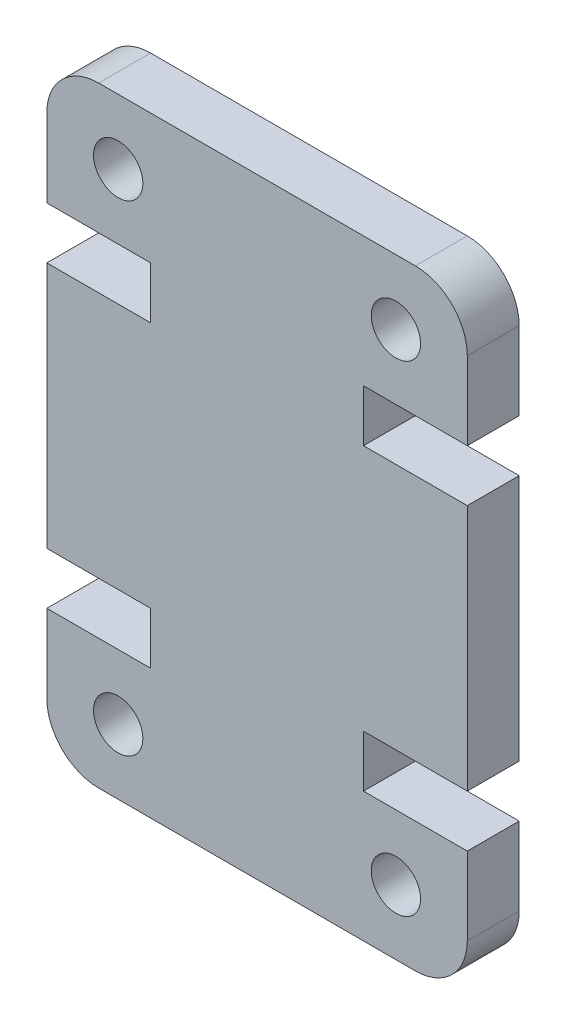
ISO-10303-21;
HEADER;
FILE_DESCRIPTION(('STEP AP214'),'2;1');
FILE_NAME('part.step','',(''),(''),'','','');
FILE_SCHEMA(('AUTOMOTIVE_DESIGN { 1 0 10303 214 1 1 1 1 }'));
ENDSEC;
DATA;
#1=APPLICATION_CONTEXT('core data for automotive mechanical design processes');
#2=APPLICATION_PROTOCOL_DEFINITION('international standard','automotive_design',2000,#1);
#3=PRODUCT_CONTEXT('',#1,'mechanical');
#4=PRODUCT('Part','Part','',(#3));
#5=PRODUCT_RELATED_PRODUCT_CATEGORY('part','',(#4));
#6=PRODUCT_DEFINITION_FORMATION('','',#4);
#7=PRODUCT_DEFINITION_CONTEXT('part definition',#1,'design');
#8=PRODUCT_DEFINITION('design','',#6,#7);
#9=PRODUCT_DEFINITION_SHAPE('','',#8);
#10=(LENGTH_UNIT() NAMED_UNIT(*) SI_UNIT(.MILLI.,.METRE.));
#11=(NAMED_UNIT(*) PLANE_ANGLE_UNIT() SI_UNIT($,.RADIAN.));
#12=(NAMED_UNIT(*) SI_UNIT($,.STERADIAN.) SOLID_ANGLE_UNIT());
#13=UNCERTAINTY_MEASURE_WITH_UNIT(LENGTH_MEASURE(1.E-05),#10,'distance_accuracy_value','');
#14=(GEOMETRIC_REPRESENTATION_CONTEXT(3) GLOBAL_UNCERTAINTY_ASSIGNED_CONTEXT((#13)) GLOBAL_UNIT_ASSIGNED_CONTEXT((#10,
#11,#12)) REPRESENTATION_CONTEXT('',''));
#15=CARTESIAN_POINT('',(0.,0.,0.));
#16=DIRECTION('',(0.,0.,1.));
#17=DIRECTION('',(1.,0.,0.));
#18=AXIS2_PLACEMENT_3D('',#15,#16,#17);
#19=CARTESIAN_POINT('',(14.2,2.,2.));
#20=DIRECTION('',(0.,0.,-1.));
#21=DIRECTION('',(-1.,0.,0.));
#22=AXIS2_PLACEMENT_3D('',#19,#20,#21);
#23=PLANE('',#22);
#24=CARTESIAN_POINT('',(13.4499999999986,21.0250000000001,2.));
#25=DIRECTION('',(0.,0.,1.));
#26=DIRECTION('',(1.,0.,0.));
#27=AXIS2_PLACEMENT_3D('',#24,#25,#26);
#28=CIRCLE('',#27,0.949999999999999);
#29=CARTESIAN_POINT('',(14.3999999999986,21.0250000000001,2.));
#30=VERTEX_POINT('',#29);
#31=EDGE_CURVE('E448',#30,#30,#28,.T.);
#32=ORIENTED_EDGE('',*,*,#31,.F.);
#33=EDGE_LOOP('',(#32));
#34=FACE_BOUND('',#33,.T.);
#35=CARTESIAN_POINT('',(13.4499999999986,2.4999999999999,2.));
#36=DIRECTION('',(0.,0.,1.));
#37=DIRECTION('',(-1.,0.,0.));
#38=AXIS2_PLACEMENT_3D('',#35,#36,#37);
#39=CIRCLE('',#38,0.949999999999999);
#40=CARTESIAN_POINT('',(12.4999999999986,2.4999999999999,2.));
#41=VERTEX_POINT('',#40);
#42=EDGE_CURVE('E230',#41,#41,#39,.T.);
#43=ORIENTED_EDGE('',*,*,#42,.F.);
#44=EDGE_LOOP('',(#43));
#45=FACE_BOUND('',#44,.T.);
#46=CARTESIAN_POINT('',(14.2,2.,2.));
#47=DIRECTION('',(0.,0.,1.));
#48=DIRECTION('',(-1.,0.,0.));
#49=AXIS2_PLACEMENT_3D('',#46,#47,#48);
#50=CIRCLE('',#49,2.);
#51=CARTESIAN_POINT('',(14.2,0.,2.));
#52=VERTEX_POINT('',#51);
#53=CARTESIAN_POINT('',(16.2,2.,2.));
#54=VERTEX_POINT('',#53);
#55=EDGE_CURVE('E273',#52,#54,#50,.T.);
#56=ORIENTED_EDGE('',*,*,#55,.T.);
#57=DIRECTION('',(0.,1.,0.));
#58=VECTOR('',#57,1.);
#59=CARTESIAN_POINT('',(16.2,5.00000000000014,2.));
#60=LINE('',#59,#58);
#61=CARTESIAN_POINT('',(16.2,5.00000000000014,2.));
#62=VERTEX_POINT('',#61);
#63=EDGE_CURVE('E141',#54,#62,#60,.T.);
#64=ORIENTED_EDGE('',*,*,#63,.T.);
#65=DIRECTION('',(-1.,0.,0.));
#66=VECTOR('',#65,1.);
#67=CARTESIAN_POINT('',(12.2,5.00000000000014,2.));
#68=LINE('',#67,#66);
#69=CARTESIAN_POINT('',(12.2,5.00000000000014,2.));
#70=VERTEX_POINT('',#69);
#71=EDGE_CURVE('E336',#62,#70,#68,.T.);
#72=ORIENTED_EDGE('',*,*,#71,.T.);
#73=DIRECTION('',(0.,1.,0.));
#74=VECTOR('',#73,1.);
#75=CARTESIAN_POINT('',(12.2,7.00000000000014,2.));
#76=LINE('',#75,#74);
#77=CARTESIAN_POINT('',(12.2,7.00000000000014,2.));
#78=VERTEX_POINT('',#77);
#79=EDGE_CURVE('E355',#70,#78,#76,.T.);
#80=ORIENTED_EDGE('',*,*,#79,.T.);
#81=DIRECTION('',(1.,0.,0.));
#82=VECTOR('',#81,1.);
#83=CARTESIAN_POINT('',(16.2,7.00000000000014,2.));
#84=LINE('',#83,#82);
#85=CARTESIAN_POINT('',(16.2,7.00000000000014,2.));
#86=VERTEX_POINT('',#85);
#87=EDGE_CURVE('E352',#78,#86,#84,.T.);
#88=ORIENTED_EDGE('',*,*,#87,.T.);
#89=DIRECTION('',(0.,1.,0.));
#90=VECTOR('',#89,1.);
#91=CARTESIAN_POINT('',(16.2,7.00000000000014,2.));
#92=LINE('',#91,#90);
#93=CARTESIAN_POINT('',(16.2,16.5249999999999,2.));
#94=VERTEX_POINT('',#93);
#95=EDGE_CURVE('E354',#86,#94,#92,.T.);
#96=ORIENTED_EDGE('',*,*,#95,.T.);
#97=DIRECTION('',(-1.,0.,0.));
#98=VECTOR('',#97,1.);
#99=CARTESIAN_POINT('',(16.2,16.5249999999999,2.));
#100=LINE('',#99,#98);
#101=CARTESIAN_POINT('',(12.2,16.5249999999999,2.));
#102=VERTEX_POINT('',#101);
#103=EDGE_CURVE('E357',#94,#102,#100,.T.);
#104=ORIENTED_EDGE('',*,*,#103,.T.);
#105=DIRECTION('',(0.,1.,0.));
#106=VECTOR('',#105,1.);
#107=CARTESIAN_POINT('',(12.2,16.5249999999999,2.));
#108=LINE('',#107,#106);
#109=CARTESIAN_POINT('',(12.2,18.5249999999999,2.));
#110=VERTEX_POINT('',#109);
#111=EDGE_CURVE('E363',#102,#110,#108,.T.);
#112=ORIENTED_EDGE('',*,*,#111,.T.);
#113=DIRECTION('',(1.,0.,0.));
#114=VECTOR('',#113,1.);
#115=CARTESIAN_POINT('',(12.2,18.5249999999999,2.));
#116=LINE('',#115,#114);
#117=CARTESIAN_POINT('',(16.2,18.5249999999999,2.));
#118=VERTEX_POINT('',#117);
#119=EDGE_CURVE('E365',#110,#118,#116,.T.);
#120=ORIENTED_EDGE('',*,*,#119,.T.);
#121=DIRECTION('',(0.,1.,0.));
#122=VECTOR('',#121,1.);
#123=CARTESIAN_POINT('',(16.2,18.5249999999999,2.));
#124=LINE('',#123,#122);
#125=CARTESIAN_POINT('',(16.2,21.525,2.));
#126=VERTEX_POINT('',#125);
#127=EDGE_CURVE('E367',#118,#126,#124,.T.);
#128=ORIENTED_EDGE('',*,*,#127,.T.);
#129=CARTESIAN_POINT('',(14.2,21.525,2.));
#130=DIRECTION('',(0.,0.,1.));
#131=DIRECTION('',(1.,0.,0.));
#132=AXIS2_PLACEMENT_3D('',#129,#130,#131);
#133=CIRCLE('',#132,2.);
#134=CARTESIAN_POINT('',(14.2,23.525,2.));
#135=VERTEX_POINT('',#134);
#136=EDGE_CURVE('E369',#126,#135,#133,.T.);
#137=ORIENTED_EDGE('',*,*,#136,.T.);
#138=DIRECTION('',(-1.,0.,0.));
#139=VECTOR('',#138,1.);
#140=CARTESIAN_POINT('',(1.99999999999999,23.525,2.));
#141=LINE('',#140,#139);
#142=CARTESIAN_POINT('',(1.99999999999999,23.525,2.));
#143=VERTEX_POINT('',#142);
#144=EDGE_CURVE('E371',#135,#143,#141,.T.);
#145=ORIENTED_EDGE('',*,*,#144,.T.);
#146=CARTESIAN_POINT('',(2.,21.525,2.));
#147=DIRECTION('',(0.,0.,1.));
#148=DIRECTION('',(-1.,0.,0.));
#149=AXIS2_PLACEMENT_3D('',#146,#147,#148);
#150=CIRCLE('',#149,2.);
#151=CARTESIAN_POINT('',(0.,21.525,2.));
#152=VERTEX_POINT('',#151);
#153=EDGE_CURVE('E373',#143,#152,#150,.T.);
#154=ORIENTED_EDGE('',*,*,#153,.T.);
#155=DIRECTION('',(0.,-1.,0.));
#156=VECTOR('',#155,1.);
#157=CARTESIAN_POINT('',(0.,18.5249999999999,2.));
#158=LINE('',#157,#156);
#159=CARTESIAN_POINT('',(0.,18.5249999999999,2.));
#160=VERTEX_POINT('',#159);
#161=EDGE_CURVE('E375',#152,#160,#158,.T.);
#162=ORIENTED_EDGE('',*,*,#161,.T.);
#163=DIRECTION('',(1.,0.,0.));
#164=VECTOR('',#163,1.);
#165=CARTESIAN_POINT('',(4.,18.5249999999999,2.));
#166=LINE('',#165,#164);
#167=CARTESIAN_POINT('',(4.,18.5249999999999,2.));
#168=VERTEX_POINT('',#167);
#169=EDGE_CURVE('E377',#160,#168,#166,.T.);
#170=ORIENTED_EDGE('',*,*,#169,.T.);
#171=DIRECTION('',(0.,-1.,0.));
#172=VECTOR('',#171,1.);
#173=CARTESIAN_POINT('',(4.,16.5249999999999,2.));
#174=LINE('',#173,#172);
#175=CARTESIAN_POINT('',(4.,16.5249999999999,2.));
#176=VERTEX_POINT('',#175);
#177=EDGE_CURVE('E379',#168,#176,#174,.T.);
#178=ORIENTED_EDGE('',*,*,#177,.T.);
#179=DIRECTION('',(-1.,0.,0.));
#180=VECTOR('',#179,1.);
#181=CARTESIAN_POINT('',(0.,16.5249999999999,2.));
#182=LINE('',#181,#180);
#183=CARTESIAN_POINT('',(0.,16.5249999999999,2.));
#184=VERTEX_POINT('',#183);
#185=EDGE_CURVE('E381',#176,#184,#182,.T.);
#186=ORIENTED_EDGE('',*,*,#185,.T.);
#187=DIRECTION('',(0.,-1.,0.));
#188=VECTOR('',#187,1.);
#189=CARTESIAN_POINT('',(0.,7.00000000000012,2.));
#190=LINE('',#189,#188);
#191=CARTESIAN_POINT('',(0.,7.00000000000012,2.));
#192=VERTEX_POINT('',#191);
#193=EDGE_CURVE('E383',#184,#192,#190,.T.);
#194=ORIENTED_EDGE('',*,*,#193,.T.);
#195=DIRECTION('',(1.,0.,0.));
#196=VECTOR('',#195,1.);
#197=CARTESIAN_POINT('',(0.,7.00000000000012,2.));
#198=LINE('',#197,#196);
#199=CARTESIAN_POINT('',(4.,7.00000000000014,2.));
#200=VERTEX_POINT('',#199);
#201=EDGE_CURVE('E385',#192,#200,#198,.T.);
#202=ORIENTED_EDGE('',*,*,#201,.T.);
#203=DIRECTION('',(0.,-1.,0.));
#204=VECTOR('',#203,1.);
#205=CARTESIAN_POINT('',(4.,7.00000000000014,2.));
#206=LINE('',#205,#204);
#207=CARTESIAN_POINT('',(4.,5.00000000000014,2.));
#208=VERTEX_POINT('',#207);
#209=EDGE_CURVE('E387',#200,#208,#206,.T.);
#210=ORIENTED_EDGE('',*,*,#209,.T.);
#211=DIRECTION('',(-1.,0.,0.));
#212=VECTOR('',#211,1.);
#213=CARTESIAN_POINT('',(4.,5.00000000000014,2.));
#214=LINE('',#213,#212);
#215=CARTESIAN_POINT('',(0.,5.00000000000014,2.));
#216=VERTEX_POINT('',#215);
#217=EDGE_CURVE('E208',#208,#216,#214,.T.);
#218=ORIENTED_EDGE('',*,*,#217,.T.);
#219=DIRECTION('',(0.,-1.,0.));
#220=VECTOR('',#219,1.);
#221=CARTESIAN_POINT('',(0.,5.00000000000014,2.));
#222=LINE('',#221,#220);
#223=CARTESIAN_POINT('',(0.,2.00000000000002,2.));
#224=VERTEX_POINT('',#223);
#225=EDGE_CURVE('E202',#216,#224,#222,.T.);
#226=ORIENTED_EDGE('',*,*,#225,.T.);
#227=CARTESIAN_POINT('',(2.,2.,2.));
#228=DIRECTION('',(0.,0.,1.));
#229=DIRECTION('',(1.,0.,0.));
#230=AXIS2_PLACEMENT_3D('',#227,#228,#229);
#231=CIRCLE('',#230,2.);
#232=CARTESIAN_POINT('',(2.,0.,2.));
#233=VERTEX_POINT('',#232);
#234=EDGE_CURVE('E206',#224,#233,#231,.T.);
#235=ORIENTED_EDGE('',*,*,#234,.T.);
#236=DIRECTION('',(1.,0.,0.));
#237=VECTOR('',#236,1.);
#238=CARTESIAN_POINT('',(2.,0.,2.));
#239=LINE('',#238,#237);
#240=EDGE_CURVE('E50',#233,#52,#239,.T.);
#241=ORIENTED_EDGE('',*,*,#240,.T.);
#242=EDGE_LOOP('',(#56,#64,#72,#80,#88,#96,#104,#112,#120,#128,#137,#145,#154,#162,#170,#178,
#186,#194,#202,#210,#218,#226,#235,#241));
#243=FACE_BOUND('',#242,.T.);
#244=CARTESIAN_POINT('',(2.75000000000137,21.0250000000001,2.));
#245=DIRECTION('',(0.,0.,1.));
#246=DIRECTION('',(-1.,0.,0.));
#247=AXIS2_PLACEMENT_3D('',#244,#245,#246);
#248=CIRCLE('',#247,0.95);
#249=CARTESIAN_POINT('',(1.80000000000137,21.0250000000001,2.));
#250=VERTEX_POINT('',#249);
#251=EDGE_CURVE('E454',#250,#250,#248,.T.);
#252=ORIENTED_EDGE('',*,*,#251,.F.);
#253=EDGE_LOOP('',(#252));
#254=FACE_BOUND('',#253,.T.);
#255=CARTESIAN_POINT('',(2.75000000000138,2.4999999999999,2.));
#256=DIRECTION('',(0.,0.,1.));
#257=DIRECTION('',(1.,0.,0.));
#258=AXIS2_PLACEMENT_3D('',#255,#256,#257);
#259=CIRCLE('',#258,0.95);
#260=CARTESIAN_POINT('',(3.70000000000138,2.4999999999999,2.));
#261=VERTEX_POINT('',#260);
#262=EDGE_CURVE('E439',#261,#261,#259,.T.);
#263=ORIENTED_EDGE('',*,*,#262,.F.);
#264=EDGE_LOOP('',(#263));
#265=FACE_BOUND('',#264,.T.);
#266=ADVANCED_FACE('F33',(#34,#45,#243,#254,#265),#23,.F.);
#267=CARTESIAN_POINT('',(14.2,2.,0.));
#268=DIRECTION('',(0.,0.,-1.));
#269=DIRECTION('',(-1.,0.,0.));
#270=AXIS2_PLACEMENT_3D('',#267,#268,#269);
#271=PLANE('',#270);
#272=CARTESIAN_POINT('',(13.4499999999986,21.0250000000001,0.));
#273=DIRECTION('',(0.,0.,1.));
#274=DIRECTION('',(1.,0.,0.));
#275=AXIS2_PLACEMENT_3D('',#272,#273,#274);
#276=CIRCLE('',#275,0.949999999999999);
#277=CARTESIAN_POINT('',(14.3999999999986,21.0250000000001,0.));
#278=VERTEX_POINT('',#277);
#279=EDGE_CURVE('E445',#278,#278,#276,.T.);
#280=ORIENTED_EDGE('',*,*,#279,.T.);
#281=EDGE_LOOP('',(#280));
#282=FACE_BOUND('',#281,.T.);
#283=CARTESIAN_POINT('',(13.4499999999986,2.4999999999999,0.));
#284=DIRECTION('',(0.,0.,1.));
#285=DIRECTION('',(-1.,0.,0.));
#286=AXIS2_PLACEMENT_3D('',#283,#284,#285);
#287=CIRCLE('',#286,0.949999999999999);
#288=CARTESIAN_POINT('',(12.4999999999986,2.4999999999999,0.));
#289=VERTEX_POINT('',#288);
#290=EDGE_CURVE('E457',#289,#289,#287,.T.);
#291=ORIENTED_EDGE('',*,*,#290,.T.);
#292=EDGE_LOOP('',(#291));
#293=FACE_BOUND('',#292,.T.);
#294=CARTESIAN_POINT('',(14.2,2.,0.));
#295=DIRECTION('',(0.,0.,1.));
#296=DIRECTION('',(-1.,0.,0.));
#297=AXIS2_PLACEMENT_3D('',#294,#295,#296);
#298=CIRCLE('',#297,2.);
#299=CARTESIAN_POINT('',(14.2,0.,0.));
#300=VERTEX_POINT('',#299);
#301=CARTESIAN_POINT('',(16.2,2.,0.));
#302=VERTEX_POINT('',#301);
#303=EDGE_CURVE('E226',#300,#302,#298,.T.);
#304=ORIENTED_EDGE('',*,*,#303,.F.);
#305=DIRECTION('',(1.,0.,0.));
#306=VECTOR('',#305,1.);
#307=CARTESIAN_POINT('',(2.,0.,0.));
#308=LINE('',#307,#306);
#309=CARTESIAN_POINT('',(2.,0.,0.));
#310=VERTEX_POINT('',#309);
#311=EDGE_CURVE('E133',#310,#300,#308,.T.);
#312=ORIENTED_EDGE('',*,*,#311,.F.);
#313=CARTESIAN_POINT('',(2.,2.,0.));
#314=DIRECTION('',(0.,0.,1.));
#315=DIRECTION('',(1.,0.,0.));
#316=AXIS2_PLACEMENT_3D('',#313,#314,#315);
#317=CIRCLE('',#316,2.);
#318=CARTESIAN_POINT('',(0.,2.00000000000002,0.));
#319=VERTEX_POINT('',#318);
#320=EDGE_CURVE('E127',#319,#310,#317,.T.);
#321=ORIENTED_EDGE('',*,*,#320,.F.);
#322=DIRECTION('',(0.,-1.,0.));
#323=VECTOR('',#322,1.);
#324=CARTESIAN_POINT('',(0.,5.00000000000014,0.));
#325=LINE('',#324,#323);
#326=CARTESIAN_POINT('',(0.,5.00000000000014,0.));
#327=VERTEX_POINT('',#326);
#328=EDGE_CURVE('E216',#327,#319,#325,.T.);
#329=ORIENTED_EDGE('',*,*,#328,.F.);
#330=DIRECTION('',(-1.,0.,0.));
#331=VECTOR('',#330,1.);
#332=CARTESIAN_POINT('',(4.,5.00000000000014,0.));
#333=LINE('',#332,#331);
#334=CARTESIAN_POINT('',(4.,5.00000000000014,0.));
#335=VERTEX_POINT('',#334);
#336=EDGE_CURVE('E268',#335,#327,#333,.T.);
#337=ORIENTED_EDGE('',*,*,#336,.F.);
#338=DIRECTION('',(0.,-1.,0.));
#339=VECTOR('',#338,1.);
#340=CARTESIAN_POINT('',(4.,7.00000000000014,0.));
#341=LINE('',#340,#339);
#342=CARTESIAN_POINT('',(4.,7.00000000000014,0.));
#343=VERTEX_POINT('',#342);
#344=EDGE_CURVE('E266',#343,#335,#341,.T.);
#345=ORIENTED_EDGE('',*,*,#344,.F.);
#346=DIRECTION('',(1.,0.,0.));
#347=VECTOR('',#346,1.);
#348=CARTESIAN_POINT('',(0.,7.00000000000012,0.));
#349=LINE('',#348,#347);
#350=CARTESIAN_POINT('',(0.,7.00000000000012,0.));
#351=VERTEX_POINT('',#350);
#352=EDGE_CURVE('E264',#351,#343,#349,.T.);
#353=ORIENTED_EDGE('',*,*,#352,.F.);
#354=DIRECTION('',(0.,-1.,0.));
#355=VECTOR('',#354,1.);
#356=CARTESIAN_POINT('',(0.,7.00000000000012,0.));
#357=LINE('',#356,#355);
#358=CARTESIAN_POINT('',(0.,16.5249999999999,0.));
#359=VERTEX_POINT('',#358);
#360=EDGE_CURVE('E262',#359,#351,#357,.T.);
#361=ORIENTED_EDGE('',*,*,#360,.F.);
#362=DIRECTION('',(-1.,0.,0.));
#363=VECTOR('',#362,1.);
#364=CARTESIAN_POINT('',(0.,16.5249999999999,0.));
#365=LINE('',#364,#363);
#366=CARTESIAN_POINT('',(4.,16.5249999999999,0.));
#367=VERTEX_POINT('',#366);
#368=EDGE_CURVE('E260',#367,#359,#365,.T.);
#369=ORIENTED_EDGE('',*,*,#368,.F.);
#370=DIRECTION('',(0.,-1.,0.));
#371=VECTOR('',#370,1.);
#372=CARTESIAN_POINT('',(4.,16.5249999999999,0.));
#373=LINE('',#372,#371);
#374=CARTESIAN_POINT('',(4.,18.5249999999999,0.));
#375=VERTEX_POINT('',#374);
#376=EDGE_CURVE('E258',#375,#367,#373,.T.);
#377=ORIENTED_EDGE('',*,*,#376,.F.);
#378=DIRECTION('',(1.,0.,0.));
#379=VECTOR('',#378,1.);
#380=CARTESIAN_POINT('',(4.,18.5249999999999,0.));
#381=LINE('',#380,#379);
#382=CARTESIAN_POINT('',(0.,18.5249999999999,0.));
#383=VERTEX_POINT('',#382);
#384=EDGE_CURVE('E256',#383,#375,#381,.T.);
#385=ORIENTED_EDGE('',*,*,#384,.F.);
#386=DIRECTION('',(0.,-1.,0.));
#387=VECTOR('',#386,1.);
#388=CARTESIAN_POINT('',(0.,18.5249999999999,0.));
#389=LINE('',#388,#387);
#390=CARTESIAN_POINT('',(0.,21.525,0.));
#391=VERTEX_POINT('',#390);
#392=EDGE_CURVE('E254',#391,#383,#389,.T.);
#393=ORIENTED_EDGE('',*,*,#392,.F.);
#394=CARTESIAN_POINT('',(2.,21.525,0.));
#395=DIRECTION('',(0.,0.,1.));
#396=DIRECTION('',(-1.,0.,0.));
#397=AXIS2_PLACEMENT_3D('',#394,#395,#396);
#398=CIRCLE('',#397,2.);
#399=CARTESIAN_POINT('',(1.99999999999999,23.525,0.));
#400=VERTEX_POINT('',#399);
#401=EDGE_CURVE('E252',#400,#391,#398,.T.);
#402=ORIENTED_EDGE('',*,*,#401,.F.);
#403=DIRECTION('',(-1.,0.,0.));
#404=VECTOR('',#403,1.);
#405=CARTESIAN_POINT('',(1.99999999999999,23.525,0.));
#406=LINE('',#405,#404);
#407=CARTESIAN_POINT('',(14.2,23.525,0.));
#408=VERTEX_POINT('',#407);
#409=EDGE_CURVE('E250',#408,#400,#406,.T.);
#410=ORIENTED_EDGE('',*,*,#409,.F.);
#411=CARTESIAN_POINT('',(14.2,21.525,0.));
#412=DIRECTION('',(0.,0.,1.));
#413=DIRECTION('',(1.,0.,0.));
#414=AXIS2_PLACEMENT_3D('',#411,#412,#413);
#415=CIRCLE('',#414,2.);
#416=CARTESIAN_POINT('',(16.2,21.525,0.));
#417=VERTEX_POINT('',#416);
#418=EDGE_CURVE('E248',#417,#408,#415,.T.);
#419=ORIENTED_EDGE('',*,*,#418,.F.);
#420=DIRECTION('',(0.,1.,0.));
#421=VECTOR('',#420,1.);
#422=CARTESIAN_POINT('',(16.2,18.5249999999999,0.));
#423=LINE('',#422,#421);
#424=CARTESIAN_POINT('',(16.2,18.5249999999999,0.));
#425=VERTEX_POINT('',#424);
#426=EDGE_CURVE('E246',#425,#417,#423,.T.);
#427=ORIENTED_EDGE('',*,*,#426,.F.);
#428=DIRECTION('',(1.,0.,0.));
#429=VECTOR('',#428,1.);
#430=CARTESIAN_POINT('',(12.2,18.5249999999999,0.));
#431=LINE('',#430,#429);
#432=CARTESIAN_POINT('',(12.2,18.5249999999999,0.));
#433=VERTEX_POINT('',#432);
#434=EDGE_CURVE('E244',#433,#425,#431,.T.);
#435=ORIENTED_EDGE('',*,*,#434,.F.);
#436=DIRECTION('',(0.,1.,0.));
#437=VECTOR('',#436,1.);
#438=CARTESIAN_POINT('',(12.2,16.5249999999999,0.));
#439=LINE('',#438,#437);
#440=CARTESIAN_POINT('',(12.2,16.5249999999999,0.));
#441=VERTEX_POINT('',#440);
#442=EDGE_CURVE('E242',#441,#433,#439,.T.);
#443=ORIENTED_EDGE('',*,*,#442,.F.);
#444=DIRECTION('',(-1.,0.,0.));
#445=VECTOR('',#444,1.);
#446=CARTESIAN_POINT('',(16.2,16.5249999999999,0.));
#447=LINE('',#446,#445);
#448=CARTESIAN_POINT('',(16.2,16.5249999999999,0.));
#449=VERTEX_POINT('',#448);
#450=EDGE_CURVE('E240',#449,#441,#447,.T.);
#451=ORIENTED_EDGE('',*,*,#450,.F.);
#452=DIRECTION('',(0.,1.,0.));
#453=VECTOR('',#452,1.);
#454=CARTESIAN_POINT('',(16.2,7.00000000000014,0.));
#455=LINE('',#454,#453);
#456=CARTESIAN_POINT('',(16.2,7.00000000000014,0.));
#457=VERTEX_POINT('',#456);
#458=EDGE_CURVE('E238',#457,#449,#455,.T.);
#459=ORIENTED_EDGE('',*,*,#458,.F.);
#460=DIRECTION('',(1.,0.,0.));
#461=VECTOR('',#460,1.);
#462=CARTESIAN_POINT('',(16.2,7.00000000000014,0.));
#463=LINE('',#462,#461);
#464=CARTESIAN_POINT('',(12.2,7.00000000000014,0.));
#465=VERTEX_POINT('',#464);
#466=EDGE_CURVE('E236',#465,#457,#463,.T.);
#467=ORIENTED_EDGE('',*,*,#466,.F.);
#468=DIRECTION('',(0.,1.,0.));
#469=VECTOR('',#468,1.);
#470=CARTESIAN_POINT('',(12.2,7.00000000000014,0.));
#471=LINE('',#470,#469);
#472=CARTESIAN_POINT('',(12.2,5.00000000000014,0.));
#473=VERTEX_POINT('',#472);
#474=EDGE_CURVE('E234',#473,#465,#471,.T.);
#475=ORIENTED_EDGE('',*,*,#474,.F.);
#476=DIRECTION('',(-1.,0.,0.));
#477=VECTOR('',#476,1.);
#478=CARTESIAN_POINT('',(12.2,5.00000000000014,0.));
#479=LINE('',#478,#477);
#480=CARTESIAN_POINT('',(16.2,5.00000000000014,0.));
#481=VERTEX_POINT('',#480);
#482=EDGE_CURVE('E232',#481,#473,#479,.T.);
#483=ORIENTED_EDGE('',*,*,#482,.F.);
#484=DIRECTION('',(0.,1.,0.));
#485=VECTOR('',#484,1.);
#486=CARTESIAN_POINT('',(16.2,5.00000000000014,0.));
#487=LINE('',#486,#485);
#488=EDGE_CURVE('E229',#302,#481,#487,.T.);
#489=ORIENTED_EDGE('',*,*,#488,.F.);
#490=EDGE_LOOP('',(#304,#312,#321,#329,#337,#345,#353,#361,#369,#377,#385,#393,#402,#410,#419,
#427,#435,#443,#451,#459,#467,#475,#483,#489));
#491=FACE_BOUND('',#490,.T.);
#492=CARTESIAN_POINT('',(2.75000000000137,21.0250000000001,0.));
#493=DIRECTION('',(0.,0.,1.));
#494=DIRECTION('',(-1.,0.,0.));
#495=AXIS2_PLACEMENT_3D('',#492,#493,#494);
#496=CIRCLE('',#495,0.95);
#497=CARTESIAN_POINT('',(1.80000000000137,21.0250000000001,0.));
#498=VERTEX_POINT('',#497);
#499=EDGE_CURVE('E451',#498,#498,#496,.T.);
#500=ORIENTED_EDGE('',*,*,#499,.T.);
#501=EDGE_LOOP('',(#500));
#502=FACE_BOUND('',#501,.T.);
#503=CARTESIAN_POINT('',(2.75000000000138,2.4999999999999,0.));
#504=DIRECTION('',(0.,0.,1.));
#505=DIRECTION('',(1.,0.,0.));
#506=AXIS2_PLACEMENT_3D('',#503,#504,#505);
#507=CIRCLE('',#506,0.95);
#508=CARTESIAN_POINT('',(3.70000000000138,2.4999999999999,0.));
#509=VERTEX_POINT('',#508);
#510=EDGE_CURVE('E442',#509,#509,#507,.T.);
#511=ORIENTED_EDGE('',*,*,#510,.T.);
#512=EDGE_LOOP('',(#511));
#513=FACE_BOUND('',#512,.T.);
#514=ADVANCED_FACE('F340',(#282,#293,#491,#502,#513),#271,.T.);
#515=CARTESIAN_POINT('',(14.2,2.,2.));
#516=DIRECTION('',(0.,0.,-1.));
#517=DIRECTION('',(-1.,0.,0.));
#518=AXIS2_PLACEMENT_3D('',#515,#516,#517);
#519=CYLINDRICAL_SURFACE('',#518,2.);
#520=ORIENTED_EDGE('',*,*,#303,.T.);
#521=DIRECTION('',(0.,0.,-1.));
#522=VECTOR('',#521,1.);
#523=CARTESIAN_POINT('',(16.2,2.,2.));
#524=LINE('',#523,#522);
#525=EDGE_CURVE('E11',#54,#302,#524,.T.);
#526=ORIENTED_EDGE('',*,*,#525,.F.);
#527=ORIENTED_EDGE('',*,*,#55,.F.);
#528=DIRECTION('',(0.,0.,-1.));
#529=VECTOR('',#528,1.);
#530=CARTESIAN_POINT('',(14.2,0.,2.));
#531=LINE('',#530,#529);
#532=EDGE_CURVE('E222',#52,#300,#531,.T.);
#533=ORIENTED_EDGE('',*,*,#532,.T.);
#534=EDGE_LOOP('',(#520,#526,#527,#533));
#535=FACE_BOUND('',#534,.T.);
#536=ADVANCED_FACE('F35',(#535),#519,.T.);
#537=CARTESIAN_POINT('',(16.2,5.00000000000014,2.));
#538=DIRECTION('',(-1.,0.,0.));
#539=DIRECTION('',(0.,-1.,0.));
#540=AXIS2_PLACEMENT_3D('',#537,#538,#539);
#541=PLANE('',#540);
#542=ORIENTED_EDGE('',*,*,#488,.T.);
#543=DIRECTION('',(0.,0.,-1.));
#544=VECTOR('',#543,1.);
#545=CARTESIAN_POINT('',(16.2,5.00000000000014,2.));
#546=LINE('',#545,#544);
#547=EDGE_CURVE('E42',#62,#481,#546,.T.);
#548=ORIENTED_EDGE('',*,*,#547,.F.);
#549=ORIENTED_EDGE('',*,*,#63,.F.);
#550=ORIENTED_EDGE('',*,*,#525,.T.);
#551=EDGE_LOOP('',(#542,#548,#549,#550));
#552=FACE_BOUND('',#551,.T.);
#553=ADVANCED_FACE('F686',(#552),#541,.F.);
#554=CARTESIAN_POINT('',(12.2,5.00000000000014,2.));
#555=DIRECTION('',(0.,-1.,0.));
#556=DIRECTION('',(0.,0.,-1.));
#557=AXIS2_PLACEMENT_3D('',#554,#555,#556);
#558=PLANE('',#557);
#559=ORIENTED_EDGE('',*,*,#482,.T.);
#560=DIRECTION('',(0.,0.,-1.));
#561=VECTOR('',#560,1.);
#562=CARTESIAN_POINT('',(12.2,5.00000000000014,2.));
#563=LINE('',#562,#561);
#564=EDGE_CURVE('E328',#70,#473,#563,.T.);
#565=ORIENTED_EDGE('',*,*,#564,.F.);
#566=ORIENTED_EDGE('',*,*,#71,.F.);
#567=ORIENTED_EDGE('',*,*,#547,.T.);
#568=EDGE_LOOP('',(#559,#565,#566,#567));
#569=FACE_BOUND('',#568,.T.);
#570=ADVANCED_FACE('F334',(#569),#558,.F.);
#571=CARTESIAN_POINT('',(12.2,7.00000000000014,2.));
#572=DIRECTION('',(-1.,0.,0.));
#573=DIRECTION('',(0.,0.,1.));
#574=AXIS2_PLACEMENT_3D('',#571,#572,#573);
#575=PLANE('',#574);
#576=ORIENTED_EDGE('',*,*,#474,.T.);
#577=DIRECTION('',(0.,0.,-1.));
#578=VECTOR('',#577,1.);
#579=CARTESIAN_POINT('',(12.2,7.00000000000014,2.));
#580=LINE('',#579,#578);
#581=EDGE_CURVE('E325',#78,#465,#580,.T.);
#582=ORIENTED_EDGE('',*,*,#581,.F.);
#583=ORIENTED_EDGE('',*,*,#79,.F.);
#584=ORIENTED_EDGE('',*,*,#564,.T.);
#585=EDGE_LOOP('',(#576,#582,#583,#584));
#586=FACE_BOUND('',#585,.T.);
#587=ADVANCED_FACE('F346',(#586),#575,.F.);
#588=CARTESIAN_POINT('',(16.2,7.00000000000014,2.));
#589=DIRECTION('',(0.,1.,0.));
#590=DIRECTION('',(-1.,0.,0.));
#591=AXIS2_PLACEMENT_3D('',#588,#589,#590);
#592=PLANE('',#591);
#593=ORIENTED_EDGE('',*,*,#466,.T.);
#594=DIRECTION('',(0.,0.,-1.));
#595=VECTOR('',#594,1.);
#596=CARTESIAN_POINT('',(16.2,7.00000000000014,2.));
#597=LINE('',#596,#595);
#598=EDGE_CURVE('E322',#86,#457,#597,.T.);
#599=ORIENTED_EDGE('',*,*,#598,.F.);
#600=ORIENTED_EDGE('',*,*,#87,.F.);
#601=ORIENTED_EDGE('',*,*,#581,.T.);
#602=EDGE_LOOP('',(#593,#599,#600,#601));
#603=FACE_BOUND('',#602,.T.);
#604=ADVANCED_FACE('F350',(#603),#592,.F.);
#605=CARTESIAN_POINT('',(16.2,7.00000000000014,2.));
#606=DIRECTION('',(-1.,0.,0.));
#607=DIRECTION('',(0.,0.,1.));
#608=AXIS2_PLACEMENT_3D('',#605,#606,#607);
#609=PLANE('',#608);
#610=ORIENTED_EDGE('',*,*,#458,.T.);
#611=DIRECTION('',(0.,0.,-1.));
#612=VECTOR('',#611,1.);
#613=CARTESIAN_POINT('',(16.2,16.5249999999999,2.));
#614=LINE('',#613,#612);
#615=EDGE_CURVE('E319',#94,#449,#614,.T.);
#616=ORIENTED_EDGE('',*,*,#615,.F.);
#617=ORIENTED_EDGE('',*,*,#95,.F.);
#618=ORIENTED_EDGE('',*,*,#598,.T.);
#619=EDGE_LOOP('',(#610,#616,#617,#618));
#620=FACE_BOUND('',#619,.T.);
#621=ADVANCED_FACE('F651',(#620),#609,.F.);
#622=CARTESIAN_POINT('',(16.2,16.5249999999999,2.));
#623=DIRECTION('',(0.,-1.,0.));
#624=DIRECTION('',(1.,0.,0.));
#625=AXIS2_PLACEMENT_3D('',#622,#623,#624);
#626=PLANE('',#625);
#627=ORIENTED_EDGE('',*,*,#450,.T.);
#628=DIRECTION('',(0.,0.,-1.));
#629=VECTOR('',#628,1.);
#630=CARTESIAN_POINT('',(12.2,16.5249999999999,2.));
#631=LINE('',#630,#629);
#632=EDGE_CURVE('E316',#102,#441,#631,.T.);
#633=ORIENTED_EDGE('',*,*,#632,.F.);
#634=ORIENTED_EDGE('',*,*,#103,.F.);
#635=ORIENTED_EDGE('',*,*,#615,.T.);
#636=EDGE_LOOP('',(#627,#633,#634,#635));
#637=FACE_BOUND('',#636,.T.);
#638=ADVANCED_FACE('F641',(#637),#626,.F.);
#639=CARTESIAN_POINT('',(12.2,16.5249999999999,2.));
#640=DIRECTION('',(-1.,0.,0.));
#641=DIRECTION('',(0.,0.,1.));
#642=AXIS2_PLACEMENT_3D('',#639,#640,#641);
#643=PLANE('',#642);
#644=ORIENTED_EDGE('',*,*,#442,.T.);
#645=DIRECTION('',(0.,0.,-1.));
#646=VECTOR('',#645,1.);
#647=CARTESIAN_POINT('',(12.2,18.5249999999999,2.));
#648=LINE('',#647,#646);
#649=EDGE_CURVE('E313',#110,#433,#648,.T.);
#650=ORIENTED_EDGE('',*,*,#649,.F.);
#651=ORIENTED_EDGE('',*,*,#111,.F.);
#652=ORIENTED_EDGE('',*,*,#632,.T.);
#653=EDGE_LOOP('',(#644,#650,#651,#652));
#654=FACE_BOUND('',#653,.T.);
#655=ADVANCED_FACE('F631',(#654),#643,.F.);
#656=CARTESIAN_POINT('',(12.2,18.5249999999999,2.));
#657=DIRECTION('',(0.,1.,0.));
#658=DIRECTION('',(0.,0.,1.));
#659=AXIS2_PLACEMENT_3D('',#656,#657,#658);
#660=PLANE('',#659);
#661=ORIENTED_EDGE('',*,*,#434,.T.);
#662=DIRECTION('',(0.,0.,-1.));
#663=VECTOR('',#662,1.);
#664=CARTESIAN_POINT('',(16.2,18.5249999999999,2.));
#665=LINE('',#664,#663);
#666=EDGE_CURVE('E310',#118,#425,#665,.T.);
#667=ORIENTED_EDGE('',*,*,#666,.F.);
#668=ORIENTED_EDGE('',*,*,#119,.F.);
#669=ORIENTED_EDGE('',*,*,#649,.T.);
#670=EDGE_LOOP('',(#661,#667,#668,#669));
#671=FACE_BOUND('',#670,.T.);
#672=ADVANCED_FACE('F621',(#671),#660,.F.);
#673=CARTESIAN_POINT('',(16.2,18.5249999999999,2.));
#674=DIRECTION('',(-1.,0.,0.));
#675=DIRECTION('',(0.,-1.,0.));
#676=AXIS2_PLACEMENT_3D('',#673,#674,#675);
#677=PLANE('',#676);
#678=ORIENTED_EDGE('',*,*,#426,.T.);
#679=DIRECTION('',(0.,0.,-1.));
#680=VECTOR('',#679,1.);
#681=CARTESIAN_POINT('',(16.2,21.525,2.));
#682=LINE('',#681,#680);
#683=EDGE_CURVE('E307',#126,#417,#682,.T.);
#684=ORIENTED_EDGE('',*,*,#683,.F.);
#685=ORIENTED_EDGE('',*,*,#127,.F.);
#686=ORIENTED_EDGE('',*,*,#666,.T.);
#687=EDGE_LOOP('',(#678,#684,#685,#686));
#688=FACE_BOUND('',#687,.T.);
#689=ADVANCED_FACE('F611',(#688),#677,.F.);
#690=CARTESIAN_POINT('',(14.2,21.525,2.));
#691=DIRECTION('',(0.,0.,-1.));
#692=DIRECTION('',(-1.,0.,0.));
#693=AXIS2_PLACEMENT_3D('',#690,#691,#692);
#694=CYLINDRICAL_SURFACE('',#693,2.);
#695=ORIENTED_EDGE('',*,*,#418,.T.);
#696=DIRECTION('',(0.,0.,-1.));
#697=VECTOR('',#696,1.);
#698=CARTESIAN_POINT('',(14.2,23.525,2.));
#699=LINE('',#698,#697);
#700=EDGE_CURVE('E304',#135,#408,#699,.T.);
#701=ORIENTED_EDGE('',*,*,#700,.F.);
#702=ORIENTED_EDGE('',*,*,#136,.F.);
#703=ORIENTED_EDGE('',*,*,#683,.T.);
#704=EDGE_LOOP('',(#695,#701,#702,#703));
#705=FACE_BOUND('',#704,.T.);
#706=ADVANCED_FACE('F601',(#705),#694,.T.);
#707=CARTESIAN_POINT('',(1.99999999999999,23.525,2.));
#708=DIRECTION('',(0.,-1.,0.));
#709=DIRECTION('',(0.,0.,-1.));
#710=AXIS2_PLACEMENT_3D('',#707,#708,#709);
#711=PLANE('',#710);
#712=ORIENTED_EDGE('',*,*,#409,.T.);
#713=DIRECTION('',(0.,0.,-1.));
#714=VECTOR('',#713,1.);
#715=CARTESIAN_POINT('',(1.99999999999999,23.525,2.));
#716=LINE('',#715,#714);
#717=EDGE_CURVE('E301',#143,#400,#716,.T.);
#718=ORIENTED_EDGE('',*,*,#717,.F.);
#719=ORIENTED_EDGE('',*,*,#144,.F.);
#720=ORIENTED_EDGE('',*,*,#700,.T.);
#721=EDGE_LOOP('',(#712,#718,#719,#720));
#722=FACE_BOUND('',#721,.T.);
#723=ADVANCED_FACE('F591',(#722),#711,.F.);
#724=CARTESIAN_POINT('',(2.,21.525,2.));
#725=DIRECTION('',(0.,0.,-1.));
#726=DIRECTION('',(-1.,0.,0.));
#727=AXIS2_PLACEMENT_3D('',#724,#725,#726);
#728=CYLINDRICAL_SURFACE('',#727,2.);
#729=ORIENTED_EDGE('',*,*,#401,.T.);
#730=DIRECTION('',(0.,0.,-1.));
#731=VECTOR('',#730,1.);
#732=CARTESIAN_POINT('',(0.,21.525,2.));
#733=LINE('',#732,#731);
#734=EDGE_CURVE('E298',#152,#391,#733,.T.);
#735=ORIENTED_EDGE('',*,*,#734,.F.);
#736=ORIENTED_EDGE('',*,*,#153,.F.);
#737=ORIENTED_EDGE('',*,*,#717,.T.);
#738=EDGE_LOOP('',(#729,#735,#736,#737));
#739=FACE_BOUND('',#738,.T.);
#740=ADVANCED_FACE('F581',(#739),#728,.T.);
#741=CARTESIAN_POINT('',(0.,18.5249999999999,2.));
#742=DIRECTION('',(1.,0.,0.));
#743=DIRECTION('',(0.,1.,0.));
#744=AXIS2_PLACEMENT_3D('',#741,#742,#743);
#745=PLANE('',#744);
#746=ORIENTED_EDGE('',*,*,#392,.T.);
#747=DIRECTION('',(0.,0.,-1.));
#748=VECTOR('',#747,1.);
#749=CARTESIAN_POINT('',(0.,18.5249999999999,2.));
#750=LINE('',#749,#748);
#751=EDGE_CURVE('E295',#160,#383,#750,.T.);
#752=ORIENTED_EDGE('',*,*,#751,.F.);
#753=ORIENTED_EDGE('',*,*,#161,.F.);
#754=ORIENTED_EDGE('',*,*,#734,.T.);
#755=EDGE_LOOP('',(#746,#752,#753,#754));
#756=FACE_BOUND('',#755,.T.);
#757=ADVANCED_FACE('F571',(#756),#745,.F.);
#758=CARTESIAN_POINT('',(4.,18.5249999999999,2.));
#759=DIRECTION('',(0.,1.,0.));
#760=DIRECTION('',(-1.,0.,0.));
#761=AXIS2_PLACEMENT_3D('',#758,#759,#760);
#762=PLANE('',#761);
#763=ORIENTED_EDGE('',*,*,#384,.T.);
#764=DIRECTION('',(0.,0.,-1.));
#765=VECTOR('',#764,1.);
#766=CARTESIAN_POINT('',(4.,18.5249999999999,2.));
#767=LINE('',#766,#765);
#768=EDGE_CURVE('E292',#168,#375,#767,.T.);
#769=ORIENTED_EDGE('',*,*,#768,.F.);
#770=ORIENTED_EDGE('',*,*,#169,.F.);
#771=ORIENTED_EDGE('',*,*,#751,.T.);
#772=EDGE_LOOP('',(#763,#769,#770,#771));
#773=FACE_BOUND('',#772,.T.);
#774=ADVANCED_FACE('F561',(#773),#762,.F.);
#775=CARTESIAN_POINT('',(4.,16.5249999999999,2.));
#776=DIRECTION('',(1.,0.,0.));
#777=DIRECTION('',(0.,0.,-1.));
#778=AXIS2_PLACEMENT_3D('',#775,#776,#777);
#779=PLANE('',#778);
#780=ORIENTED_EDGE('',*,*,#376,.T.);
#781=DIRECTION('',(0.,0.,-1.));
#782=VECTOR('',#781,1.);
#783=CARTESIAN_POINT('',(4.,16.5249999999999,2.));
#784=LINE('',#783,#782);
#785=EDGE_CURVE('E289',#176,#367,#784,.T.);
#786=ORIENTED_EDGE('',*,*,#785,.F.);
#787=ORIENTED_EDGE('',*,*,#177,.F.);
#788=ORIENTED_EDGE('',*,*,#768,.T.);
#789=EDGE_LOOP('',(#780,#786,#787,#788));
#790=FACE_BOUND('',#789,.T.);
#791=ADVANCED_FACE('F551',(#790),#779,.F.);
#792=CARTESIAN_POINT('',(0.,16.5249999999999,2.));
#793=DIRECTION('',(0.,-1.,0.));
#794=DIRECTION('',(1.,0.,0.));
#795=AXIS2_PLACEMENT_3D('',#792,#793,#794);
#796=PLANE('',#795);
#797=ORIENTED_EDGE('',*,*,#368,.T.);
#798=DIRECTION('',(0.,0.,-1.));
#799=VECTOR('',#798,1.);
#800=CARTESIAN_POINT('',(0.,16.5249999999999,2.));
#801=LINE('',#800,#799);
#802=EDGE_CURVE('E286',#184,#359,#801,.T.);
#803=ORIENTED_EDGE('',*,*,#802,.F.);
#804=ORIENTED_EDGE('',*,*,#185,.F.);
#805=ORIENTED_EDGE('',*,*,#785,.T.);
#806=EDGE_LOOP('',(#797,#803,#804,#805));
#807=FACE_BOUND('',#806,.T.);
#808=ADVANCED_FACE('F541',(#807),#796,.F.);
#809=CARTESIAN_POINT('',(0.,7.00000000000012,2.));
#810=DIRECTION('',(1.,0.,0.));
#811=DIRECTION('',(0.,0.,-1.));
#812=AXIS2_PLACEMENT_3D('',#809,#810,#811);
#813=PLANE('',#812);
#814=ORIENTED_EDGE('',*,*,#360,.T.);
#815=DIRECTION('',(0.,0.,-1.));
#816=VECTOR('',#815,1.);
#817=CARTESIAN_POINT('',(0.,7.00000000000012,2.));
#818=LINE('',#817,#816);
#819=EDGE_CURVE('E283',#192,#351,#818,.T.);
#820=ORIENTED_EDGE('',*,*,#819,.F.);
#821=ORIENTED_EDGE('',*,*,#193,.F.);
#822=ORIENTED_EDGE('',*,*,#802,.T.);
#823=EDGE_LOOP('',(#814,#820,#821,#822));
#824=FACE_BOUND('',#823,.T.);
#825=ADVANCED_FACE('F531',(#824),#813,.F.);
#826=CARTESIAN_POINT('',(0.,7.00000000000012,2.));
#827=DIRECTION('',(0.,1.,0.));
#828=DIRECTION('',(-1.,0.,0.));
#829=AXIS2_PLACEMENT_3D('',#826,#827,#828);
#830=PLANE('',#829);
#831=ORIENTED_EDGE('',*,*,#352,.T.);
#832=DIRECTION('',(0.,0.,-1.));
#833=VECTOR('',#832,1.);
#834=CARTESIAN_POINT('',(4.,7.00000000000014,2.));
#835=LINE('',#834,#833);
#836=EDGE_CURVE('E280',#200,#343,#835,.T.);
#837=ORIENTED_EDGE('',*,*,#836,.F.);
#838=ORIENTED_EDGE('',*,*,#201,.F.);
#839=ORIENTED_EDGE('',*,*,#819,.T.);
#840=EDGE_LOOP('',(#831,#837,#838,#839));
#841=FACE_BOUND('',#840,.T.);
#842=ADVANCED_FACE('F522',(#841),#830,.F.);
#843=CARTESIAN_POINT('',(4.,7.00000000000014,2.));
#844=DIRECTION('',(1.,0.,0.));
#845=DIRECTION('',(0.,0.,-1.));
#846=AXIS2_PLACEMENT_3D('',#843,#844,#845);
#847=PLANE('',#846);
#848=ORIENTED_EDGE('',*,*,#344,.T.);
#849=DIRECTION('',(0.,0.,-1.));
#850=VECTOR('',#849,1.);
#851=CARTESIAN_POINT('',(4.,5.00000000000014,2.));
#852=LINE('',#851,#850);
#853=EDGE_CURVE('E277',#208,#335,#852,.T.);
#854=ORIENTED_EDGE('',*,*,#853,.F.);
#855=ORIENTED_EDGE('',*,*,#209,.F.);
#856=ORIENTED_EDGE('',*,*,#836,.T.);
#857=EDGE_LOOP('',(#848,#854,#855,#856));
#858=FACE_BOUND('',#857,.T.);
#859=ADVANCED_FACE('F393',(#858),#847,.F.);
#860=CARTESIAN_POINT('',(4.,5.00000000000014,2.));
#861=DIRECTION('',(0.,-1.,0.));
#862=DIRECTION('',(1.,0.,0.));
#863=AXIS2_PLACEMENT_3D('',#860,#861,#862);
#864=PLANE('',#863);
#865=ORIENTED_EDGE('',*,*,#336,.T.);
#866=DIRECTION('',(0.,0.,-1.));
#867=VECTOR('',#866,1.);
#868=CARTESIAN_POINT('',(0.,5.00000000000014,2.));
#869=LINE('',#868,#867);
#870=EDGE_CURVE('E217',#216,#327,#869,.T.);
#871=ORIENTED_EDGE('',*,*,#870,.F.);
#872=ORIENTED_EDGE('',*,*,#217,.F.);
#873=ORIENTED_EDGE('',*,*,#853,.T.);
#874=EDGE_LOOP('',(#865,#871,#872,#873));
#875=FACE_BOUND('',#874,.T.);
#876=ADVANCED_FACE('F397',(#875),#864,.F.);
#877=CARTESIAN_POINT('',(0.,5.00000000000014,2.));
#878=DIRECTION('',(1.,0.,0.));
#879=DIRECTION('',(0.,0.,-1.));
#880=AXIS2_PLACEMENT_3D('',#877,#878,#879);
#881=PLANE('',#880);
#882=ORIENTED_EDGE('',*,*,#328,.T.);
#883=DIRECTION('',(0.,0.,-1.));
#884=VECTOR('',#883,1.);
#885=CARTESIAN_POINT('',(0.,2.00000000000002,2.));
#886=LINE('',#885,#884);
#887=EDGE_CURVE('E213',#224,#319,#886,.T.);
#888=ORIENTED_EDGE('',*,*,#887,.F.);
#889=ORIENTED_EDGE('',*,*,#225,.F.);
#890=ORIENTED_EDGE('',*,*,#870,.T.);
#891=EDGE_LOOP('',(#882,#888,#889,#890));
#892=FACE_BOUND('',#891,.T.);
#893=ADVANCED_FACE('F214',(#892),#881,.F.);
#894=CARTESIAN_POINT('',(2.,2.,2.));
#895=DIRECTION('',(0.,0.,-1.));
#896=DIRECTION('',(-1.,0.,0.));
#897=AXIS2_PLACEMENT_3D('',#894,#895,#896);
#898=CYLINDRICAL_SURFACE('',#897,2.);
#899=ORIENTED_EDGE('',*,*,#320,.T.);
#900=DIRECTION('',(0.,0.,-1.));
#901=VECTOR('',#900,1.);
#902=CARTESIAN_POINT('',(2.,0.,2.));
#903=LINE('',#902,#901);
#904=EDGE_CURVE('E218',#233,#310,#903,.T.);
#905=ORIENTED_EDGE('',*,*,#904,.F.);
#906=ORIENTED_EDGE('',*,*,#234,.F.);
#907=ORIENTED_EDGE('',*,*,#887,.T.);
#908=EDGE_LOOP('',(#899,#905,#906,#907));
#909=FACE_BOUND('',#908,.T.);
#910=ADVANCED_FACE('F220',(#909),#898,.T.);
#911=CARTESIAN_POINT('',(2.,0.,2.));
#912=DIRECTION('',(0.,1.,0.));
#913=DIRECTION('',(-1.,0.,0.));
#914=AXIS2_PLACEMENT_3D('',#911,#912,#913);
#915=PLANE('',#914);
#916=ORIENTED_EDGE('',*,*,#311,.T.);
#917=ORIENTED_EDGE('',*,*,#532,.F.);
#918=ORIENTED_EDGE('',*,*,#240,.F.);
#919=ORIENTED_EDGE('',*,*,#904,.T.);
#920=EDGE_LOOP('',(#916,#917,#918,#919));
#921=FACE_BOUND('',#920,.T.);
#922=ADVANCED_FACE('F401',(#921),#915,.F.);
#923=CARTESIAN_POINT('',(13.4499999999986,2.4999999999999,2.));
#924=DIRECTION('',(0.,0.,-1.));
#925=DIRECTION('',(-1.,0.,0.));
#926=AXIS2_PLACEMENT_3D('',#923,#924,#925);
#927=CYLINDRICAL_SURFACE('',#926,0.949999999999999);
#928=ORIENTED_EDGE('',*,*,#42,.T.);
#929=EDGE_LOOP('',(#928));
#930=FACE_BOUND('',#929,.T.);
#931=ORIENTED_EDGE('',*,*,#290,.F.);
#932=EDGE_LOOP('',(#931));
#933=FACE_BOUND('',#932,.T.);
#934=ADVANCED_FACE('F403',(#930,#933),#927,.F.);
#935=CARTESIAN_POINT('',(2.75000000000137,21.0250000000001,2.));
#936=DIRECTION('',(0.,0.,-1.));
#937=DIRECTION('',(-1.,0.,0.));
#938=AXIS2_PLACEMENT_3D('',#935,#936,#937);
#939=CYLINDRICAL_SURFACE('',#938,0.95);
#940=ORIENTED_EDGE('',*,*,#251,.T.);
#941=EDGE_LOOP('',(#940));
#942=FACE_BOUND('',#941,.T.);
#943=ORIENTED_EDGE('',*,*,#499,.F.);
#944=EDGE_LOOP('',(#943));
#945=FACE_BOUND('',#944,.T.);
#946=ADVANCED_FACE('F409',(#942,#945),#939,.F.);
#947=CARTESIAN_POINT('',(13.4499999999986,21.0250000000001,2.));
#948=DIRECTION('',(0.,0.,-1.));
#949=DIRECTION('',(-1.,0.,0.));
#950=AXIS2_PLACEMENT_3D('',#947,#948,#949);
#951=CYLINDRICAL_SURFACE('',#950,0.949999999999999);
#952=ORIENTED_EDGE('',*,*,#31,.T.);
#953=EDGE_LOOP('',(#952));
#954=FACE_BOUND('',#953,.T.);
#955=ORIENTED_EDGE('',*,*,#279,.F.);
#956=EDGE_LOOP('',(#955));
#957=FACE_BOUND('',#956,.T.);
#958=ADVANCED_FACE('F426',(#954,#957),#951,.F.);
#959=CARTESIAN_POINT('',(2.75000000000138,2.4999999999999,2.));
#960=DIRECTION('',(0.,0.,-1.));
#961=DIRECTION('',(-1.,0.,0.));
#962=AXIS2_PLACEMENT_3D('',#959,#960,#961);
#963=CYLINDRICAL_SURFACE('',#962,0.95);
#964=ORIENTED_EDGE('',*,*,#262,.T.);
#965=EDGE_LOOP('',(#964));
#966=FACE_BOUND('',#965,.T.);
#967=ORIENTED_EDGE('',*,*,#510,.F.);
#968=EDGE_LOOP('',(#967));
#969=FACE_BOUND('',#968,.T.);
#970=ADVANCED_FACE('F430',(#966,#969),#963,.F.);
#971=CLOSED_SHELL('',(#266,#514,#536,#553,#570,#587,#604,#621,#638,#655,#672,#689,#706,#723,
#740,#757,#774,#791,#808,#825,#842,#859,#876,#893,#910,#922,#934,#946,#958,#970));
#972=MANIFOLD_SOLID_BREP('B2',#971);
#973=ADVANCED_BREP_SHAPE_REPRESENTATION('',(#18,#972),#14);
#974=SHAPE_DEFINITION_REPRESENTATION(#9,#973);
ENDSEC;
END-ISO-10303-21;
